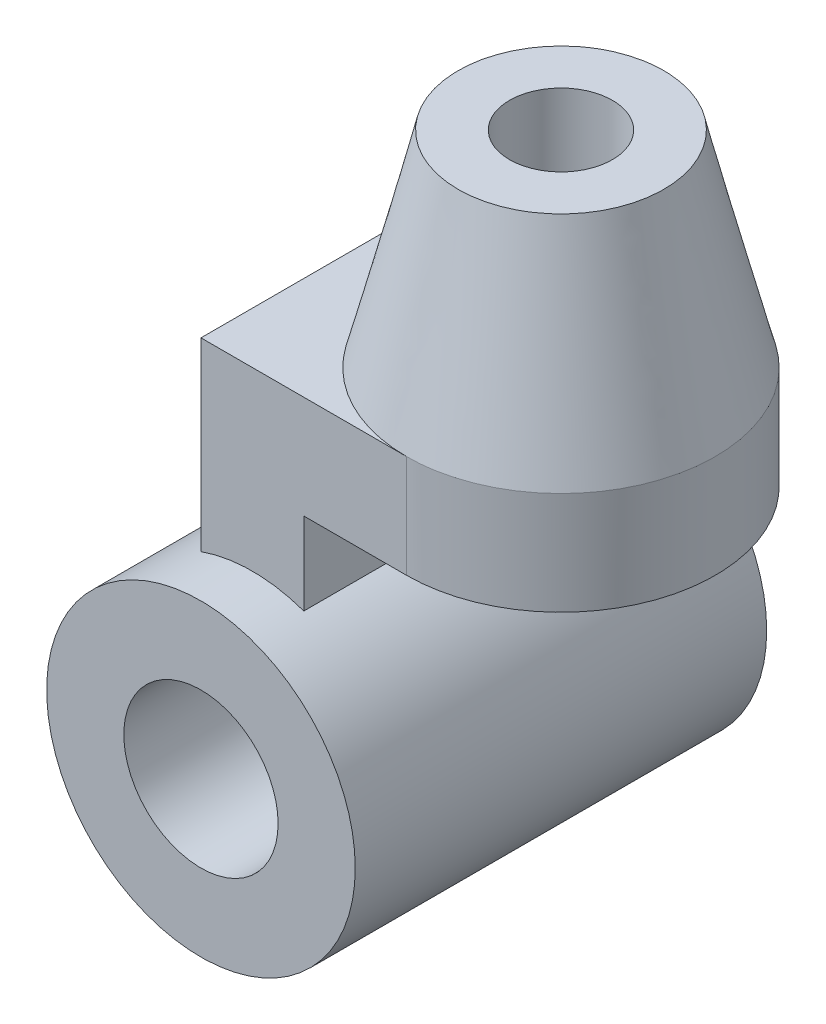
ISO-10303-21;
HEADER;
FILE_DESCRIPTION(('STEP AP214'),'2;1');
FILE_NAME('part.step','',(''),(''),'','','');
FILE_SCHEMA(('AUTOMOTIVE_DESIGN { 1 0 10303 214 1 1 1 1 }'));
ENDSEC;
DATA;
#1=APPLICATION_CONTEXT('core data for automotive mechanical design processes');
#2=APPLICATION_PROTOCOL_DEFINITION('international standard','automotive_design',2000,#1);
#3=PRODUCT_CONTEXT('',#1,'mechanical');
#4=PRODUCT('Part','Part','',(#3));
#5=PRODUCT_RELATED_PRODUCT_CATEGORY('part','',(#4));
#6=PRODUCT_DEFINITION_FORMATION('','',#4);
#7=PRODUCT_DEFINITION_CONTEXT('part definition',#1,'design');
#8=PRODUCT_DEFINITION('design','',#6,#7);
#9=PRODUCT_DEFINITION_SHAPE('','',#8);
#10=(LENGTH_UNIT() NAMED_UNIT(*) SI_UNIT(.MILLI.,.METRE.));
#11=(NAMED_UNIT(*) PLANE_ANGLE_UNIT() SI_UNIT($,.RADIAN.));
#12=(NAMED_UNIT(*) SI_UNIT($,.STERADIAN.) SOLID_ANGLE_UNIT());
#13=UNCERTAINTY_MEASURE_WITH_UNIT(LENGTH_MEASURE(1.E-05),#10,'distance_accuracy_value','');
#14=(GEOMETRIC_REPRESENTATION_CONTEXT(3) GLOBAL_UNCERTAINTY_ASSIGNED_CONTEXT((#13)) GLOBAL_UNIT_ASSIGNED_CONTEXT((#10,
#11,#12)) REPRESENTATION_CONTEXT('',''));
#15=CARTESIAN_POINT('',(0.,0.,0.));
#16=DIRECTION('',(0.,0.,1.));
#17=DIRECTION('',(1.,0.,0.));
#18=AXIS2_PLACEMENT_3D('',#15,#16,#17);
#19=CARTESIAN_POINT('',(0.,0.,40.));
#20=DIRECTION('',(0.,0.,1.));
#21=DIRECTION('',(1.,0.,0.));
#22=AXIS2_PLACEMENT_3D('',#19,#20,#21);
#23=PLANE('',#22);
#24=CARTESIAN_POINT('',(0.,0.,40.));
#25=DIRECTION('',(0.,0.,1.));
#26=DIRECTION('',(1.,0.,0.));
#27=AXIS2_PLACEMENT_3D('',#24,#25,#26);
#28=CIRCLE('',#27,30.);
#29=CARTESIAN_POINT('',(30.,0.,40.));
#30=VERTEX_POINT('',#29);
#31=EDGE_CURVE('E44',#30,#30,#28,.T.);
#32=ORIENTED_EDGE('',*,*,#31,.T.);
#33=EDGE_LOOP('',(#32));
#34=FACE_BOUND('',#33,.T.);
#35=CARTESIAN_POINT('',(0.,0.,40.));
#36=DIRECTION('',(0.,0.,1.));
#37=DIRECTION('',(1.,0.,0.));
#38=AXIS2_PLACEMENT_3D('',#35,#36,#37);
#39=CIRCLE('',#38,15.);
#40=CARTESIAN_POINT('',(15.,0.,40.));
#41=VERTEX_POINT('',#40);
#42=EDGE_CURVE('E184',#41,#41,#39,.T.);
#43=ORIENTED_EDGE('',*,*,#42,.F.);
#44=EDGE_LOOP('',(#43));
#45=FACE_BOUND('',#44,.T.);
#46=ADVANCED_FACE('F35',(#34,#45),#23,.T.);
#47=CARTESIAN_POINT('',(0.,0.,-40.));
#48=DIRECTION('',(0.,0.,1.));
#49=DIRECTION('',(1.,0.,0.));
#50=AXIS2_PLACEMENT_3D('',#47,#48,#49);
#51=PLANE('',#50);
#52=CARTESIAN_POINT('',(0.,0.,-40.));
#53=DIRECTION('',(0.,0.,1.));
#54=DIRECTION('',(1.,0.,0.));
#55=AXIS2_PLACEMENT_3D('',#52,#53,#54);
#56=CIRCLE('',#55,30.);
#57=CARTESIAN_POINT('',(30.,0.,-40.));
#58=VERTEX_POINT('',#57);
#59=EDGE_CURVE('E181',#58,#58,#56,.T.);
#60=ORIENTED_EDGE('',*,*,#59,.F.);
#61=EDGE_LOOP('',(#60));
#62=FACE_BOUND('',#61,.T.);
#63=CARTESIAN_POINT('',(0.,0.,-40.));
#64=DIRECTION('',(0.,0.,1.));
#65=DIRECTION('',(1.,0.,0.));
#66=AXIS2_PLACEMENT_3D('',#63,#64,#65);
#67=CIRCLE('',#66,15.);
#68=CARTESIAN_POINT('',(15.,0.,-40.));
#69=VERTEX_POINT('',#68);
#70=EDGE_CURVE('E187',#69,#69,#67,.T.);
#71=ORIENTED_EDGE('',*,*,#70,.T.);
#72=EDGE_LOOP('',(#71));
#73=FACE_BOUND('',#72,.T.);
#74=ADVANCED_FACE('F238',(#62,#73),#51,.F.);
#75=CARTESIAN_POINT('',(0.,0.,40.));
#76=DIRECTION('',(0.,0.,-1.));
#77=DIRECTION('',(-1.,0.,0.));
#78=AXIS2_PLACEMENT_3D('',#75,#76,#77);
#79=CYLINDRICAL_SURFACE('',#78,30.);
#80=DIRECTION('',(0.,0.,-1.));
#81=VECTOR('',#80,1.);
#82=CARTESIAN_POINT('',(9.99999999999999,28.2842712474619,30.));
#83=LINE('',#82,#81);
#84=CARTESIAN_POINT('',(9.99999999999999,28.2842712474619,30.));
#85=VERTEX_POINT('',#84);
#86=CARTESIAN_POINT('',(9.99999999999999,28.2842712474619,-30.));
#87=VERTEX_POINT('',#86);
#88=EDGE_CURVE('E56',#85,#87,#83,.T.);
#89=ORIENTED_EDGE('',*,*,#88,.F.);
#90=CARTESIAN_POINT('',(0.,0.,30.));
#91=DIRECTION('',(0.,0.,-1.));
#92=DIRECTION('',(1.,0.,0.));
#93=AXIS2_PLACEMENT_3D('',#90,#91,#92);
#94=CIRCLE('',#93,30.);
#95=CARTESIAN_POINT('',(-10.,28.2842712474619,30.));
#96=VERTEX_POINT('',#95);
#97=EDGE_CURVE('E51',#96,#85,#94,.T.);
#98=ORIENTED_EDGE('',*,*,#97,.F.);
#99=DIRECTION('',(0.,0.,-1.));
#100=VECTOR('',#99,1.);
#101=CARTESIAN_POINT('',(-10.,28.2842712474619,30.));
#102=LINE('',#101,#100);
#103=CARTESIAN_POINT('',(-10.,28.2842712474619,-30.));
#104=VERTEX_POINT('',#103);
#105=EDGE_CURVE('E194',#96,#104,#102,.T.);
#106=ORIENTED_EDGE('',*,*,#105,.T.);
#107=CARTESIAN_POINT('',(0.,0.,-30.));
#108=DIRECTION('',(0.,0.,-1.));
#109=DIRECTION('',(1.,0.,0.));
#110=AXIS2_PLACEMENT_3D('',#107,#108,#109);
#111=CIRCLE('',#110,30.);
#112=EDGE_CURVE('E202',#104,#87,#111,.T.);
#113=ORIENTED_EDGE('',*,*,#112,.T.);
#114=EDGE_LOOP('',(#89,#98,#106,#113));
#115=FACE_BOUND('',#114,.T.);
#116=ORIENTED_EDGE('',*,*,#31,.F.);
#117=EDGE_LOOP('',(#116));
#118=FACE_BOUND('',#117,.T.);
#119=ORIENTED_EDGE('',*,*,#59,.T.);
#120=EDGE_LOOP('',(#119));
#121=FACE_BOUND('',#120,.T.);
#122=ADVANCED_FACE('F37',(#115,#118,#121),#79,.T.);
#123=CARTESIAN_POINT('',(0.,0.,40.));
#124=DIRECTION('',(0.,0.,-1.));
#125=DIRECTION('',(-1.,0.,0.));
#126=AXIS2_PLACEMENT_3D('',#123,#124,#125);
#127=CYLINDRICAL_SURFACE('',#126,15.);
#128=ORIENTED_EDGE('',*,*,#42,.T.);
#129=EDGE_LOOP('',(#128));
#130=FACE_BOUND('',#129,.T.);
#131=ORIENTED_EDGE('',*,*,#70,.F.);
#132=EDGE_LOOP('',(#131));
#133=FACE_BOUND('',#132,.T.);
#134=ADVANCED_FACE('F247',(#130,#133),#127,.F.);
#135=CARTESIAN_POINT('',(-10.,64.2842712474619,30.));
#136=DIRECTION('',(0.,-1.,0.));
#137=DIRECTION('',(0.,0.,-1.));
#138=AXIS2_PLACEMENT_3D('',#135,#136,#137);
#139=PLANE('',#138);
#140=DIRECTION('',(-1.,0.,0.));
#141=VECTOR('',#140,1.);
#142=CARTESIAN_POINT('',(-10.,64.2842712474619,30.));
#143=LINE('',#142,#141);
#144=CARTESIAN_POINT('',(30.,64.2842712474619,30.));
#145=VERTEX_POINT('',#144);
#146=CARTESIAN_POINT('',(-10.,64.2842712474619,30.));
#147=VERTEX_POINT('',#146);
#148=EDGE_CURVE('E100',#145,#147,#143,.T.);
#149=ORIENTED_EDGE('',*,*,#148,.F.);
#150=CARTESIAN_POINT('',(30.,64.2842712474619,0.));
#151=DIRECTION('',(0.,-1.,0.));
#152=DIRECTION('',(0.,0.,-1.));
#153=AXIS2_PLACEMENT_3D('',#150,#151,#152);
#154=CIRCLE('',#153,30.);
#155=CARTESIAN_POINT('',(30.000274552358,64.2842712474619,-30.0000000012594));
#156=VERTEX_POINT('',#155);
#157=EDGE_CURVE('E12',#145,#156,#154,.T.);
#158=ORIENTED_EDGE('',*,*,#157,.T.);
#159=DIRECTION('',(-1.,0.,0.));
#160=VECTOR('',#159,1.);
#161=CARTESIAN_POINT('',(-10.,64.2842712474619,-30.));
#162=LINE('',#161,#160);
#163=CARTESIAN_POINT('',(-10.,64.2842712474619,-30.));
#164=VERTEX_POINT('',#163);
#165=EDGE_CURVE('E104',#156,#164,#162,.T.);
#166=ORIENTED_EDGE('',*,*,#165,.T.);
#167=DIRECTION('',(0.,0.,-1.));
#168=VECTOR('',#167,1.);
#169=CARTESIAN_POINT('',(-10.,64.2842712474619,30.));
#170=LINE('',#169,#168);
#171=EDGE_CURVE('E190',#147,#164,#170,.T.);
#172=ORIENTED_EDGE('',*,*,#171,.F.);
#173=EDGE_LOOP('',(#149,#158,#166,#172));
#174=FACE_BOUND('',#173,.T.);
#175=ADVANCED_FACE('F114',(#174),#139,.F.);
#176=CARTESIAN_POINT('',(-10.,28.2842712474619,30.));
#177=DIRECTION('',(1.,0.,0.));
#178=DIRECTION('',(0.,0.,-1.));
#179=AXIS2_PLACEMENT_3D('',#176,#177,#178);
#180=PLANE('',#179);
#181=DIRECTION('',(0.,-1.,0.));
#182=VECTOR('',#181,1.);
#183=CARTESIAN_POINT('',(-10.,28.2842712474619,-30.));
#184=LINE('',#183,#182);
#185=EDGE_CURVE('E108',#164,#104,#184,.T.);
#186=ORIENTED_EDGE('',*,*,#185,.T.);
#187=ORIENTED_EDGE('',*,*,#105,.F.);
#188=DIRECTION('',(0.,-1.,0.));
#189=VECTOR('',#188,1.);
#190=CARTESIAN_POINT('',(-10.,28.2842712474619,30.));
#191=LINE('',#190,#189);
#192=EDGE_CURVE('E174',#147,#96,#191,.T.);
#193=ORIENTED_EDGE('',*,*,#192,.F.);
#194=ORIENTED_EDGE('',*,*,#171,.T.);
#195=EDGE_LOOP('',(#186,#187,#193,#194));
#196=FACE_BOUND('',#195,.T.);
#197=ADVANCED_FACE('F253',(#196),#180,.F.);
#198=CARTESIAN_POINT('',(9.99999999999999,28.2842712474619,30.));
#199=DIRECTION('',(-1.,0.,0.));
#200=DIRECTION('',(0.,0.,1.));
#201=AXIS2_PLACEMENT_3D('',#198,#199,#200);
#202=PLANE('',#201);
#203=DIRECTION('',(0.,1.,0.));
#204=VECTOR('',#203,1.);
#205=CARTESIAN_POINT('',(9.99999999999999,28.2842712474619,-30.));
#206=LINE('',#205,#204);
#207=CARTESIAN_POINT('',(9.99999999999999,44.2842712474619,-30.));
#208=VERTEX_POINT('',#207);
#209=EDGE_CURVE('E199',#87,#208,#206,.T.);
#210=ORIENTED_EDGE('',*,*,#209,.T.);
#211=DIRECTION('',(0.,0.,-1.));
#212=VECTOR('',#211,1.);
#213=CARTESIAN_POINT('',(9.99999999999999,44.2842712474619,30.));
#214=LINE('',#213,#212);
#215=CARTESIAN_POINT('',(9.99999999999999,44.2842712474619,30.));
#216=VERTEX_POINT('',#215);
#217=EDGE_CURVE('E179',#216,#208,#214,.T.);
#218=ORIENTED_EDGE('',*,*,#217,.F.);
#219=DIRECTION('',(0.,1.,0.));
#220=VECTOR('',#219,1.);
#221=CARTESIAN_POINT('',(9.99999999999999,28.2842712474619,30.));
#222=LINE('',#221,#220);
#223=EDGE_CURVE('E206',#85,#216,#222,.T.);
#224=ORIENTED_EDGE('',*,*,#223,.F.);
#225=ORIENTED_EDGE('',*,*,#88,.T.);
#226=EDGE_LOOP('',(#210,#218,#224,#225));
#227=FACE_BOUND('',#226,.T.);
#228=ADVANCED_FACE('F256',(#227),#202,.F.);
#229=CARTESIAN_POINT('',(9.99999999999999,44.2842712474619,30.));
#230=DIRECTION('',(0.,1.,0.));
#231=DIRECTION('',(-1.,0.,0.));
#232=AXIS2_PLACEMENT_3D('',#229,#230,#231);
#233=PLANE('',#232);
#234=CARTESIAN_POINT('',(30.,44.2842712474619,0.));
#235=DIRECTION('',(0.,1.,0.));
#236=DIRECTION('',(-1.,0.,0.));
#237=AXIS2_PLACEMENT_3D('',#234,#235,#236);
#238=CIRCLE('',#237,10.);
#239=CARTESIAN_POINT('',(20.,44.2842712474619,0.));
#240=VERTEX_POINT('',#239);
#241=EDGE_CURVE('E213',#240,#240,#238,.T.);
#242=ORIENTED_EDGE('',*,*,#241,.T.);
#243=EDGE_LOOP('',(#242));
#244=FACE_BOUND('',#243,.T.);
#245=DIRECTION('',(1.,0.,0.));
#246=VECTOR('',#245,1.);
#247=CARTESIAN_POINT('',(9.99999999999999,44.2842712474619,-30.));
#248=LINE('',#247,#246);
#249=CARTESIAN_POINT('',(30.,44.2842712474619,-30.));
#250=VERTEX_POINT('',#249);
#251=EDGE_CURVE('E101',#208,#250,#248,.T.);
#252=ORIENTED_EDGE('',*,*,#251,.T.);
#253=CARTESIAN_POINT('',(30.,44.2842712474619,0.));
#254=DIRECTION('',(0.,1.,0.));
#255=DIRECTION('',(0.,0.,1.));
#256=AXIS2_PLACEMENT_3D('',#253,#254,#255);
#257=CIRCLE('',#256,30.);
#258=CARTESIAN_POINT('',(30.,44.2842712474619,30.));
#259=VERTEX_POINT('',#258);
#260=EDGE_CURVE('E97',#259,#250,#257,.T.);
#261=ORIENTED_EDGE('',*,*,#260,.F.);
#262=DIRECTION('',(1.,0.,0.));
#263=VECTOR('',#262,1.);
#264=CARTESIAN_POINT('',(9.99999999999999,44.2842712474619,30.));
#265=LINE('',#264,#263);
#266=EDGE_CURVE('E180',#216,#259,#265,.T.);
#267=ORIENTED_EDGE('',*,*,#266,.F.);
#268=ORIENTED_EDGE('',*,*,#217,.T.);
#269=EDGE_LOOP('',(#252,#261,#267,#268));
#270=FACE_BOUND('',#269,.T.);
#271=ADVANCED_FACE('F260',(#244,#270),#233,.F.);
#272=CARTESIAN_POINT('',(0.,0.,30.));
#273=DIRECTION('',(0.,0.,1.));
#274=DIRECTION('',(1.,0.,0.));
#275=AXIS2_PLACEMENT_3D('',#272,#273,#274);
#276=PLANE('',#275);
#277=ORIENTED_EDGE('',*,*,#148,.T.);
#278=ORIENTED_EDGE('',*,*,#192,.T.);
#279=ORIENTED_EDGE('',*,*,#97,.T.);
#280=ORIENTED_EDGE('',*,*,#223,.T.);
#281=ORIENTED_EDGE('',*,*,#266,.T.);
#282=DIRECTION('',(0.,1.,0.));
#283=VECTOR('',#282,1.);
#284=CARTESIAN_POINT('',(30.,64.2842712474619,30.));
#285=LINE('',#284,#283);
#286=EDGE_CURVE('E177',#259,#145,#285,.T.);
#287=ORIENTED_EDGE('',*,*,#286,.T.);
#288=EDGE_LOOP('',(#277,#278,#279,#280,#281,#287));
#289=FACE_BOUND('',#288,.T.);
#290=ADVANCED_FACE('F156',(#289),#276,.T.);
#291=CARTESIAN_POINT('',(0.,0.,-30.));
#292=DIRECTION('',(0.,0.,1.));
#293=DIRECTION('',(1.,0.,0.));
#294=AXIS2_PLACEMENT_3D('',#291,#292,#293);
#295=PLANE('',#294);
#296=ORIENTED_EDGE('',*,*,#165,.F.);
#297=DIRECTION('',(0.,1.,0.));
#298=VECTOR('',#297,1.);
#299=CARTESIAN_POINT('',(30.,64.2842712474619,-30.));
#300=LINE('',#299,#298);
#301=EDGE_CURVE('E88',#250,#156,#300,.T.);
#302=ORIENTED_EDGE('',*,*,#301,.F.);
#303=ORIENTED_EDGE('',*,*,#251,.F.);
#304=ORIENTED_EDGE('',*,*,#209,.F.);
#305=ORIENTED_EDGE('',*,*,#112,.F.);
#306=ORIENTED_EDGE('',*,*,#185,.F.);
#307=EDGE_LOOP('',(#296,#302,#303,#304,#305,#306));
#308=FACE_BOUND('',#307,.T.);
#309=ADVANCED_FACE('F105',(#308),#295,.F.);
#310=CARTESIAN_POINT('',(30.,44.2842712474619,0.));
#311=DIRECTION('',(0.,1.,0.));
#312=DIRECTION('',(0.,0.,1.));
#313=AXIS2_PLACEMENT_3D('',#310,#311,#312);
#314=CYLINDRICAL_SURFACE('',#313,30.);
#315=ORIENTED_EDGE('',*,*,#286,.F.);
#316=ORIENTED_EDGE('',*,*,#260,.T.);
#317=ORIENTED_EDGE('',*,*,#301,.T.);
#318=CARTESIAN_POINT('',(30.0000000000152,64.2842712472929,30.0000000000436));
#319=CARTESIAN_POINT('',(30.4477161212258,64.2842712472929,30.0000070199911));
#320=CARTESIAN_POINT('',(30.8954306296107,64.2842712472929,29.9899776881353));
#321=CARTESIAN_POINT('',(31.7774130596369,64.2842712472929,29.9504600026426));
#322=CARTESIAN_POINT('',(32.211705850077,64.2842712472929,29.9215254429731));
#323=CARTESIAN_POINT('',(33.0662342794766,64.2842712472929,29.8458862537055));
#324=CARTESIAN_POINT('',(33.4865170072597,64.2842712472929,29.7997129953665));
#325=CARTESIAN_POINT('',(34.3125884853837,64.2842712472929,29.691245178598));
#326=CARTESIAN_POINT('',(34.7184438413334,64.2842712472929,29.6294574673863));
#327=CARTESIAN_POINT('',(35.5153788387526,64.2842712472929,29.491342755559));
#328=CARTESIAN_POINT('',(35.9065419218522,64.2842712472929,29.4154969350453));
#329=CARTESIAN_POINT('',(36.6739479576539,64.2842712472929,29.2507745917318));
#330=CARTESIAN_POINT('',(37.0502885786043,64.2842712472929,29.1623528645118));
#331=CARTESIAN_POINT('',(37.7880251704934,64.2842712472929,28.9739058710179));
#332=CARTESIAN_POINT('',(38.1495305564557,64.2842712472929,28.8743087724272));
#333=CARTESIAN_POINT('',(38.8576755266988,64.2842712472929,28.6648524127848));
#334=CARTESIAN_POINT('',(39.2044339584104,64.2842712472929,28.5553948197791));
#335=CARTESIAN_POINT('',(39.8832517599538,64.2842712472929,28.3274705822992));
#336=CARTESIAN_POINT('',(40.2154372852393,64.2842712472929,28.2093795467848));
#337=CARTESIAN_POINT('',(40.8653496330117,64.2842712472929,27.9653526648152));
#338=CARTESIAN_POINT('',(41.1832079977486,64.2842712472929,27.8397670566961));
#339=CARTESIAN_POINT('',(41.8047670147599,64.2842712472929,27.5818272425083));
#340=CARTESIAN_POINT('',(42.1086028822122,64.2842712472929,27.4497987849943));
#341=CARTESIAN_POINT('',(42.7024668116758,64.2842712472929,27.1799634720981));
#342=CARTESIAN_POINT('',(42.9926322536688,64.2842712472929,27.042458899024));
#343=CARTESIAN_POINT('',(43.5630933554607,64.2842712472929,26.7608260599467));
#344=CARTESIAN_POINT('',(43.8434723564744,64.2842712472929,26.6168665720292));
#345=CARTESIAN_POINT('',(44.4072055471903,64.2842712472929,26.3161030511687));
#346=CARTESIAN_POINT('',(44.6904293708504,64.2842712472929,26.1590546043999));
#347=CARTESIAN_POINT('',(45.2605379991698,64.2842712472929,25.8307488085551));
#348=CARTESIAN_POINT('',(45.5472543506586,64.2842712472929,25.6591988841957));
#349=CARTESIAN_POINT('',(46.1237701913269,64.2842712472929,25.3010436193168));
#350=CARTESIAN_POINT('',(46.4133805360523,64.2842712472929,25.1141337554905));
#351=CARTESIAN_POINT('',(46.9950092033747,64.2842712472929,24.7244016652225));
#352=CARTESIAN_POINT('',(47.2868159656647,64.2842712472929,24.5212636487234));
#353=CARTESIAN_POINT('',(47.8720566188861,64.2842712472929,24.0982160145653));
#354=CARTESIAN_POINT('',(48.1652548173416,64.2842712472929,23.8779802779293));
#355=CARTESIAN_POINT('',(48.7523834197761,64.2842712472929,23.4198856075121));
#356=CARTESIAN_POINT('',(49.0460523265864,64.2842712472929,23.1816914534724));
#357=CARTESIAN_POINT('',(49.633105421644,64.2842712472929,22.686847788374));
#358=CARTESIAN_POINT('',(49.9262007314377,64.2842712472929,22.4298555013346));
#359=CARTESIAN_POINT('',(50.5109604872187,64.2842712472929,21.8966166627511));
#360=CARTESIAN_POINT('',(50.8023072533403,64.2842712472929,21.6200216679029));
#361=CARTESIAN_POINT('',(51.3822884286071,64.2842712472929,21.0468276916735));
#362=CARTESIAN_POINT('',(51.6705751646049,64.2842712472929,20.7498768490945));
#363=CARTESIAN_POINT('',(52.2430148304851,64.2842712472929,20.1352887424129));
#364=CARTESIAN_POINT('',(52.5267892125258,64.2842712472929,19.817298818572));
#365=CARTESIAN_POINT('',(53.088640165431,64.2842712472929,19.1600376499707));
#366=CARTESIAN_POINT('',(53.3663068347403,64.2842712472929,18.8204159324477));
#367=CARTESIAN_POINT('',(53.9142357477676,64.2842712472929,18.119406096158));
#368=CARTESIAN_POINT('',(54.1840567594302,64.2842712472929,17.7576730233467));
#369=CARTESIAN_POINT('',(54.714448203202,64.2842712472929,17.0120893083483));
#370=CARTESIAN_POINT('',(54.9745467030536,64.2842712472929,16.6279028690486));
#371=CARTESIAN_POINT('',(55.4835142171791,64.2842712472929,15.8372207078642));
#372=CARTESIAN_POINT('',(55.7318819420374,64.2842712472929,15.4304022274593));
#373=CARTESIAN_POINT('',(56.2152873378224,64.2842712472929,14.5944502049277));
#374=CARTESIAN_POINT('',(56.449796518828,64.2842712472929,14.1650109788129));
#375=CARTESIAN_POINT('',(56.9032785265164,64.2842712472929,13.284024350308));
#376=CARTESIAN_POINT('',(57.1216987220529,64.2842712472929,12.8321924114082));
#377=CARTESIAN_POINT('',(57.5407119458887,64.2842712472929,11.9068660409408));
#378=CARTESIAN_POINT('',(57.7407322325932,64.2842712472929,11.4331121849031));
#379=CARTESIAN_POINT('',(58.1205971268069,64.2842712472929,10.4646509301333));
#380=CARTESIAN_POINT('',(58.29985392392,64.2842712472929,9.96971290218559));
#381=CARTESIAN_POINT('',(58.6358181530619,64.2842712472929,8.95987728782542));
#382=CARTESIAN_POINT('',(58.7919287588442,64.2842712472929,8.4447810776388));
#383=CARTESIAN_POINT('',(59.0792398091549,64.2842712472929,7.39592530833955));
#384=CARTESIAN_POINT('',(59.2098414271964,64.2842712472929,6.86200164853402));
#385=CARTESIAN_POINT('',(59.443829866536,64.2842712472929,5.77710287951188));
#386=CARTESIAN_POINT('',(59.5466237369658,64.2842712472929,5.2259998411693));
#387=CARTESIAN_POINT('',(59.7227954462914,64.2842712472929,4.10866975420132));
#388=CARTESIAN_POINT('',(59.7955947732524,64.2842712472929,3.54235138948682));
#389=CARTESIAN_POINT('',(59.9097313292523,64.2842712472929,2.39685139536037));
#390=CARTESIAN_POINT('',(59.9505135322933,64.2842712472929,1.8176145932171));
#391=CARTESIAN_POINT('',(59.9987731369061,64.2842712472929,0.648780694070743));
#392=CARTESIAN_POINT('',(60.0057281538575,64.2842712472929,0.0591613811180252));
#393=CARTESIAN_POINT('',(59.9900556171937,64.2842712472929,-0.827821176866714));
#394=CARTESIAN_POINT('',(59.9803604089666,64.2842712472929,-1.12546791441403));
#395=CARTESIAN_POINT('',(59.9520217732255,64.2842712472929,-1.72226265890344));
#396=CARTESIAN_POINT('',(59.9333212369998,64.2842712472929,-2.02140802007862));
#397=CARTESIAN_POINT('',(59.8868256798395,64.2842712472929,-2.62079255272596));
#398=CARTESIAN_POINT('',(59.8589768149342,64.2842712472929,-2.92102753180748));
#399=CARTESIAN_POINT('',(59.79406155006,64.2842712472929,-3.52218724157495));
#400=CARTESIAN_POINT('',(59.7569448144266,64.2842712472929,-3.82310654166188));
#401=CARTESIAN_POINT('',(59.6733941776619,64.2842712472929,-4.42521508753881));
#402=CARTESIAN_POINT('',(59.6269136674172,64.2842712472929,-4.72639786528429));
#403=CARTESIAN_POINT('',(59.5245606774005,64.2842712472929,-5.32860511094092));
#404=CARTESIAN_POINT('',(59.4686455132432,64.2842712472929,-5.6296223248527));
#405=CARTESIAN_POINT('',(59.3473741413713,64.2842712472929,-6.23106204178024));
#406=CARTESIAN_POINT('',(59.2819793474269,64.2842712472929,-6.53147676482593));
#407=CARTESIAN_POINT('',(59.1417262142618,64.2842712472929,-7.1312692901324));
#408=CARTESIAN_POINT('',(59.0668335337293,64.2842712472929,-7.43063906251602));
#409=CARTESIAN_POINT('',(58.9075893421986,64.2842712472929,-8.02789557764443));
#410=CARTESIAN_POINT('',(58.8232078526459,64.2842712472929,-8.32577432758884));
#411=CARTESIAN_POINT('',(58.6450184423359,64.2842712472929,-8.91960091501619));
#412=CARTESIAN_POINT('',(58.5511849929276,64.2842712472929,-9.21554109232298));
#413=CARTESIAN_POINT('',(58.354152019855,64.2842712472929,-9.80504302017741));
#414=CARTESIAN_POINT('',(58.2509314724648,64.2842712472929,-10.0985977439706));
#415=CARTESIAN_POINT('',(58.0352126920335,64.2842712472929,-10.6828838062595));
#416=CARTESIAN_POINT('',(57.9226979620767,64.2842712472929,-10.9736090541721));
#417=CARTESIAN_POINT('',(57.6885071063796,64.2842712472929,-11.5517959591965));
#418=CARTESIAN_POINT('',(57.5668189987069,64.2842712472929,-11.8392527631524));
#419=CARTESIAN_POINT('',(57.3144252423932,64.2842712472929,-12.4104695162543));
#420=CARTESIAN_POINT('',(57.1837120811451,64.2842712472929,-12.694226145953));
#421=CARTESIAN_POINT('',(56.9134390962187,64.2842712472929,-13.2576183841803));
#422=CARTESIAN_POINT('',(56.7738761501155,64.2842712472929,-13.537252494809));
#423=CARTESIAN_POINT('',(56.4861007554923,64.2842712472929,-14.0919867279118));
#424=CARTESIAN_POINT('',(56.3378894629115,64.2842712472929,-14.3670874500443));
#425=CARTESIAN_POINT('',(56.0330398801811,64.2842712472929,-14.9123551639967));
#426=CARTESIAN_POINT('',(55.876406881102,64.2842712472929,-15.1825251139723));
#427=CARTESIAN_POINT('',(55.5549606134047,64.2842712472929,-15.7175466946025));
#428=CARTESIAN_POINT('',(55.390156598032,64.2842712472929,-15.9824038847352));
#429=CARTESIAN_POINT('',(55.0526379539243,64.2842712472929,-16.5064323216642));
#430=CARTESIAN_POINT('',(54.8799363400192,64.2842712472929,-16.7656119511882));
#431=CARTESIAN_POINT('',(54.5269136296811,64.2842712472929,-17.2779362848476));
#432=CARTESIAN_POINT('',(54.346609083884,64.2842712472929,-17.5310923935129));
#433=CARTESIAN_POINT('',(53.9786915165869,64.2842712472929,-18.0310408736892));
#434=CARTESIAN_POINT('',(53.791098333327,64.2842712472929,-18.2778478445778));
#435=CARTESIAN_POINT('',(53.4089326588155,64.2842712472929,-18.7647907659789));
#436=CARTESIAN_POINT('',(53.2143830257778,64.2842712472929,-19.0049446565262));
#437=CARTESIAN_POINT('',(52.8186499278773,64.2842712472929,-19.4782968684251));
#438=CARTESIAN_POINT('',(52.617492057459,64.2842712472929,-19.7115165876339));
#439=CARTESIAN_POINT('',(52.208902449396,64.2842712472929,-20.1707395799254));
#440=CARTESIAN_POINT('',(52.0014987455076,64.2842712472929,-20.3967677965966));
#441=CARTESIAN_POINT('',(51.5807896024596,64.2842712472929,-20.8413716402421));
#442=CARTESIAN_POINT('',(51.367514331468,64.2842712472929,-21.0599758134405));
#443=CARTESIAN_POINT('',(50.9354456095694,64.2842712472929,-21.4895198643535));
#444=CARTESIAN_POINT('',(50.7166841445427,64.2842712472929,-21.7004919219909));
#445=CARTESIAN_POINT('',(50.2740312430596,64.2842712472929,-22.1145882982619));
#446=CARTESIAN_POINT('',(50.0501733147482,64.2842712472929,-22.3177484147973));
#447=CARTESIAN_POINT('',(49.5977358174874,64.2842712472929,-22.7160533820501));
#448=CARTESIAN_POINT('',(49.3691908883863,64.2842712472929,-22.9112376728696));
#449=CARTESIAN_POINT('',(48.679305182048,64.2842712472929,-23.4827139276601));
#450=CARTESIAN_POINT('',(48.2094955281771,64.2842712472929,-23.8488711644187));
#451=CARTESIAN_POINT('',(47.2556808888686,64.2842712472929,-24.5476300446296));
#452=CARTESIAN_POINT('',(46.7719667334681,64.2842712472929,-24.880629710393));
#453=CARTESIAN_POINT('',(45.7935148073861,64.2842712472929,-25.5127180309465));
#454=CARTESIAN_POINT('',(45.2990663875018,64.2842712472929,-25.8122543575093));
#455=CARTESIAN_POINT('',(44.3022936237106,64.2842712472929,-26.3773957915163));
#456=CARTESIAN_POINT('',(43.8002484134072,64.2842712472929,-26.643493414613));
#457=CARTESIAN_POINT('',(42.7912941363181,64.2842712472929,-27.1420992245471));
#458=CARTESIAN_POINT('',(42.284647337335,64.2842712472929,-27.3751382112192));
#459=CARTESIAN_POINT('',(41.2693419668912,64.2842712472929,-27.8082805875067));
#460=CARTESIAN_POINT('',(40.7609231530368,64.2842712472929,-28.0089461333856));
#461=CARTESIAN_POINT('',(39.7447290062821,64.2842712472929,-28.3782719440974));
#462=CARTESIAN_POINT('',(39.2371666656129,64.2842712472929,-28.5475184268648));
#463=CARTESIAN_POINT('',(38.2251208880943,64.2842712472929,-28.8551701448589));
#464=CARTESIAN_POINT('',(37.7208206873526,64.2842712472929,-28.9941783674));
#465=CARTESIAN_POINT('',(36.717498458011,64.2842712472929,-29.2427093348933));
#466=CARTESIAN_POINT('',(36.218628129737,64.2842712472929,-29.3528447625376));
#467=CARTESIAN_POINT('',(35.2281202607566,64.2842712472929,-29.5451357280755));
#468=CARTESIAN_POINT('',(34.7366021884306,64.2842712472929,-29.6279070030867));
#469=CARTESIAN_POINT('',(33.7625069197777,64.2842712472929,-29.7670869102084));
#470=CARTESIAN_POINT('',(33.2800172010592,64.2842712472929,-29.8241082333038));
#471=CARTESIAN_POINT('',(32.3254437689724,64.2842712472929,-29.9134759955929));
#472=CARTESIAN_POINT('',(31.8534165674561,64.2842712472929,-29.9464267704121));
#473=CARTESIAN_POINT('',(30.9209995244377,64.2842712472929,-29.9893953112256));
#474=CARTESIAN_POINT('',(30.4606368511303,64.2842712472929,-30.0000040472434));
#475=CARTESIAN_POINT('',(30.0002745523427,64.2842712472929,-29.9999999987873));
#476=B_SPLINE_CURVE_WITH_KNOTS('',3,(#318,#319,#320,#321,#322,#323,#324,#325,#326,#327,#328,
#329,#330,#331,#332,#333,#334,#335,#336,#337,#338,#339,#340,#341,#342,#343,#344,#345,#346,#347,
#348,#349,#350,#351,#352,#353,#354,#355,#356,#357,#358,#359,#360,#361,#362,#363,#364,#365,#366,
#367,#368,#369,#370,#371,#372,#373,#374,#375,#376,#377,#378,#379,#380,#381,#382,#383,#384,#385,
#386,#387,#388,#389,#390,#391,#392,#393,#394,#395,#396,#397,#398,#399,#400,#401,#402,#403,#404,
#405,#406,#407,#408,#409,#410,#411,#412,#413,#414,#415,#416,#417,#418,#419,#420,#421,#422,#423,
#424,#425,#426,#427,#428,#429,#430,#431,#432,#433,#434,#435,#436,#437,#438,#439,#440,#441,#442,
#443,#444,#445,#446,#447,#448,#449,#450,#451,#452,#453,#454,#455,#456,#457,#458,#459,#460,#461,
#462,#463,#464,#465,#466,#467,#468,#469,#470,#471,#472,#473,#474,#475),.UNSPECIFIED.,.F.,.F.,(4,
2,2,2,2,2,2,2,2,2,2,2,2,2,2,2,2,2,2,2,2,2,2,2,2,2,2,2,2,2,2,2,2,2,2,2,2,2,2,2,2,2,2,2,2,2,2,2,2,
2,2,2,2,2,2,2,2,2,2,2,2,2,2,2,2,2,2,2,2,2,2,2,2,2,2,2,2,2,4),(0.,1.34303209616067,
2.64838695662685,3.91644361668801,5.1476930577831,6.34272220956041,7.50219897873317,
8.62685840089664,9.71748996662624,10.7749261362799,11.8000320285137,12.7936962449029,
13.7568227764206,14.702199054996,15.6735843528909,16.6757555974022,17.7096133165056,
18.7760405398331,19.8758944154983,21.0099967288875,22.1791232731744,23.3839920395038,
24.6252502191881,25.9034600416608,27.2190835109637,28.5724661506052,29.9638199216778,
31.3932055416341,32.86051449982,34.3654511386728,35.9075152433323,37.4859856532194,
39.0999054718127,40.7480694994982,42.4290145425086,44.141013252108,45.8820721163514,
47.6499341573295,48.5432398506271,49.4422867163404,50.3467228239985,51.2561822232271,
52.1702856625523,53.0886413919574,54.010846046119,54.9364856043246,55.8651364221607,
56.7963663291864,57.7297357859807,58.6647990931941,59.6011056445585,60.5382012152294,
61.4756292763619,62.4129323264684,63.3496532298806,64.2853365525379,65.2195298853632,
66.1517851456565,67.0816598472311,68.0087183304384,68.9325329437604,69.8526851692812,
70.7687666850736,71.6803803583332,72.5871411639481,73.4886770240872,75.2744569776271,
77.0352351824048,78.7685677904696,80.4722692483855,82.1444187004782,83.783361351152,
85.3877052636149,86.9563141708101,88.4882969331462,89.9829942999112,91.4399636221086,
92.8589621300592,94.2399293360074),.UNSPECIFIED.);
#477=EDGE_CURVE('E93',#145,#156,#476,.T.);
#478=ORIENTED_EDGE('',*,*,#477,.F.);
#479=EDGE_LOOP('',(#315,#316,#317,#478));
#480=FACE_BOUND('',#479,.T.);
#481=ADVANCED_FACE('F91',(#480),#314,.T.);
#482=CARTESIAN_POINT('',(30.,104.284271247462,0.));
#483=DIRECTION('',(0.,1.,0.));
#484=DIRECTION('',(0.,0.,1.));
#485=AXIS2_PLACEMENT_3D('',#482,#483,#484);
#486=PLANE('',#485);
#487=CARTESIAN_POINT('',(30.,104.284271247462,0.));
#488=DIRECTION('',(0.,1.,0.));
#489=DIRECTION('',(0.,0.,1.));
#490=AXIS2_PLACEMENT_3D('',#487,#488,#489);
#491=CIRCLE('',#490,10.);
#492=CARTESIAN_POINT('',(30.,104.284271247462,10.));
#493=VERTEX_POINT('',#492);
#494=EDGE_CURVE('E224',#493,#493,#491,.T.);
#495=ORIENTED_EDGE('',*,*,#494,.F.);
#496=EDGE_LOOP('',(#495));
#497=FACE_BOUND('',#496,.T.);
#498=CARTESIAN_POINT('',(30.,104.284271247462,0.));
#499=DIRECTION('',(0.,1.,0.));
#500=DIRECTION('',(0.,0.,1.));
#501=AXIS2_PLACEMENT_3D('',#498,#499,#500);
#502=CIRCLE('',#501,20.);
#503=CARTESIAN_POINT('',(30.,104.284271247462,20.));
#504=VERTEX_POINT('',#503);
#505=EDGE_CURVE('E119',#504,#504,#502,.T.);
#506=ORIENTED_EDGE('',*,*,#505,.T.);
#507=EDGE_LOOP('',(#506));
#508=FACE_BOUND('',#507,.T.);
#509=ADVANCED_FACE('F143',(#497,#508),#486,.T.);
#510=CARTESIAN_POINT('',(35.6883389849384,104.284271247462,19.1740136537041));
#511=CARTESIAN_POINT('',(43.5867833078683,64.2842712474619,26.7469497203892));
#512=CARTESIAN_POINT('',(-2.65968832246972,104.284271247462,30.5506916235809));
#513=CARTESIAN_POINT('',(-9.90711613291013,64.2842712474619,53.9205163361259));
#514=CARTESIAN_POINT('',(-14.0363662923465,104.284271247462,-7.79733568382724));
#515=CARTESIAN_POINT('',(-37.0806827486468,64.2842712474619,0.42661689534745));
#516=CARTESIAN_POINT('',(24.3116610150616,104.284271247462,-19.1740136537041));
#517=CARTESIAN_POINT('',(16.4132166921317,64.2842712474619,-26.7469497203892));
#518=CARTESIAN_POINT('',(62.6596883224697,104.284271247462,-30.5506916235809));
#519=CARTESIAN_POINT('',(69.9071161329101,64.2842712474619,-53.9205163361259));
#520=CARTESIAN_POINT('',(74.0363662923465,104.284271247462,7.79733568382725));
#521=CARTESIAN_POINT('',(97.0806827486468,64.2842712474619,-0.426616895347447));
#522=CARTESIAN_POINT('',(35.6883389849384,104.284271247462,19.1740136537041));
#523=CARTESIAN_POINT('',(43.5867833078683,64.2842712474619,26.7469497203892));
#524=(BOUNDED_SURFACE() B_SPLINE_SURFACE(3,1,((#510,#511),(#512,#513),(#514,#515),(#516,#517),
(#518,#519),(#520,#521),(#522,#523)),.UNSPECIFIED.,.T.,.F.,.F.) B_SPLINE_SURFACE_WITH_KNOTS((4,
3,4),(2,2),(0.,0.5,1.),(0.,1.),
.UNSPECIFIED.) GEOMETRIC_REPRESENTATION_ITEM() RATIONAL_B_SPLINE_SURFACE(((1.,1.),
(0.333333333333333,0.333333333333333),(0.333333333333333,0.333333333333333),(1.,1.),
(0.333333333333333,0.333333333333333),(0.333333333333333,0.333333333333333),(1.,1.))) REPRESENTATION_ITEM('') SURFACE());
#525=ORIENTED_EDGE('',*,*,#505,.F.);
#526=EDGE_LOOP('',(#525));
#527=FACE_BOUND('',#526,.T.);
#528=ORIENTED_EDGE('',*,*,#477,.T.);
#529=ORIENTED_EDGE('',*,*,#157,.F.);
#530=EDGE_LOOP('',(#528,#529));
#531=FACE_BOUND('',#530,.T.);
#532=ADVANCED_FACE('F118',(#527,#531),#524,.T.);
#533=CARTESIAN_POINT('',(30.,34.2842712474619,0.));
#534=DIRECTION('',(0.,1.,0.));
#535=DIRECTION('',(0.,0.,1.));
#536=AXIS2_PLACEMENT_3D('',#533,#534,#535);
#537=CYLINDRICAL_SURFACE('',#536,10.);
#538=ORIENTED_EDGE('',*,*,#494,.T.);
#539=EDGE_LOOP('',(#538));
#540=FACE_BOUND('',#539,.T.);
#541=ORIENTED_EDGE('',*,*,#241,.F.);
#542=EDGE_LOOP('',(#541));
#543=FACE_BOUND('',#542,.T.);
#544=ADVANCED_FACE('F142',(#540,#543),#537,.F.);
#545=CLOSED_SHELL('',(#46,#74,#122,#134,#175,#197,#228,#271,#290,#309,#481,#509,#532,#544));
#546=MANIFOLD_SOLID_BREP('B2',#545);
#547=ADVANCED_BREP_SHAPE_REPRESENTATION('',(#18,#546),#14);
#548=SHAPE_DEFINITION_REPRESENTATION(#9,#547);
ENDSEC;
END-ISO-10303-21;
